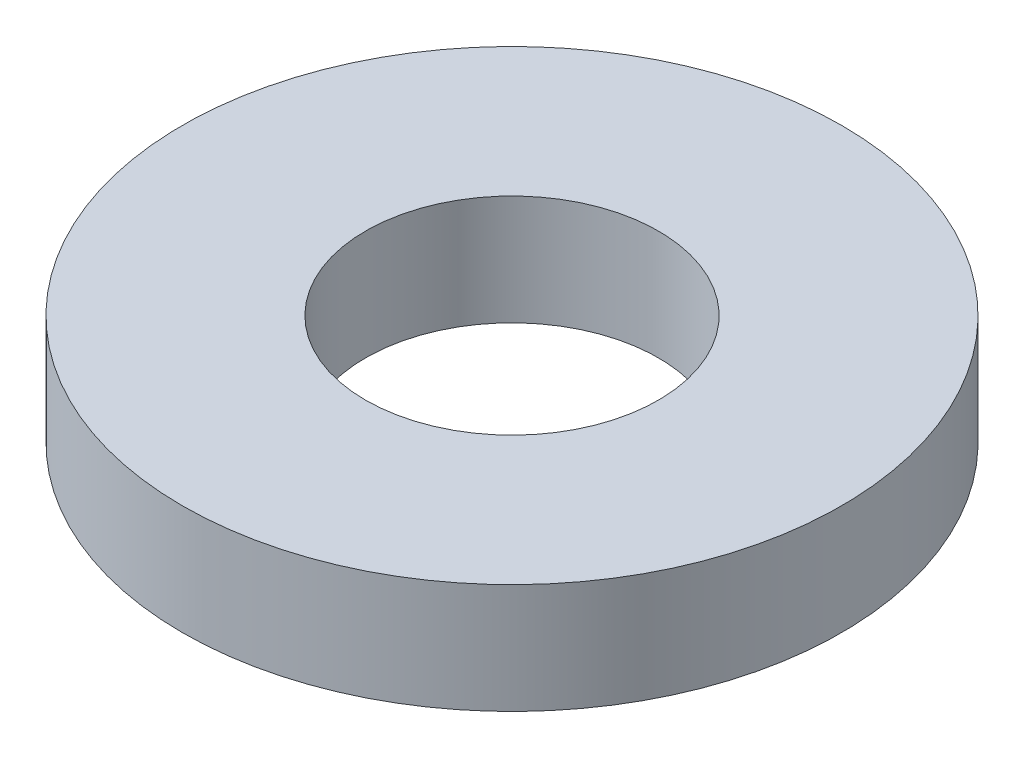
ISO-10303-21;
HEADER;
FILE_DESCRIPTION(('STEP AP214'),'2;1');
FILE_NAME('part.step','',(''),(''),'','','');
FILE_SCHEMA(('AUTOMOTIVE_DESIGN { 1 0 10303 214 1 1 1 1 }'));
ENDSEC;
DATA;
#1=APPLICATION_CONTEXT('core data for automotive mechanical design processes');
#2=APPLICATION_PROTOCOL_DEFINITION('international standard','automotive_design',2000,#1);
#3=PRODUCT_CONTEXT('',#1,'mechanical');
#4=PRODUCT('Part','Part','',(#3));
#5=PRODUCT_RELATED_PRODUCT_CATEGORY('part','',(#4));
#6=PRODUCT_DEFINITION_FORMATION('','',#4);
#7=PRODUCT_DEFINITION_CONTEXT('part definition',#1,'design');
#8=PRODUCT_DEFINITION('design','',#6,#7);
#9=PRODUCT_DEFINITION_SHAPE('','',#8);
#10=(LENGTH_UNIT() NAMED_UNIT(*) SI_UNIT(.MILLI.,.METRE.));
#11=(NAMED_UNIT(*) PLANE_ANGLE_UNIT() SI_UNIT($,.RADIAN.));
#12=(NAMED_UNIT(*) SI_UNIT($,.STERADIAN.) SOLID_ANGLE_UNIT());
#13=UNCERTAINTY_MEASURE_WITH_UNIT(LENGTH_MEASURE(1.E-05),#10,'distance_accuracy_value','');
#14=(GEOMETRIC_REPRESENTATION_CONTEXT(3) GLOBAL_UNCERTAINTY_ASSIGNED_CONTEXT((#13)) GLOBAL_UNIT_ASSIGNED_CONTEXT((#10,
#11,#12)) REPRESENTATION_CONTEXT('',''));
#15=CARTESIAN_POINT('',(0.,0.,0.));
#16=DIRECTION('',(0.,0.,1.));
#17=DIRECTION('',(1.,0.,0.));
#18=AXIS2_PLACEMENT_3D('',#15,#16,#17);
#19=CARTESIAN_POINT('',(0.,30.,0.));
#20=DIRECTION('',(0.,-1.,0.));
#21=DIRECTION('',(0.,0.,-1.));
#22=AXIS2_PLACEMENT_3D('',#19,#20,#21);
#23=CYLINDRICAL_SURFACE('',#22,90.);
#24=CARTESIAN_POINT('',(0.,30.,0.));
#25=DIRECTION('',(0.,1.,0.));
#26=DIRECTION('',(0.,0.,1.));
#27=AXIS2_PLACEMENT_3D('',#24,#25,#26);
#28=CIRCLE('',#27,90.);
#29=CARTESIAN_POINT('',(0.,30.,90.));
#30=VERTEX_POINT('',#29);
#31=EDGE_CURVE('E10',#30,#30,#28,.T.);
#32=ORIENTED_EDGE('',*,*,#31,.F.);
#33=EDGE_LOOP('',(#32));
#34=FACE_BOUND('',#33,.T.);
#35=CARTESIAN_POINT('',(0.,0.,0.));
#36=DIRECTION('',(0.,1.,0.));
#37=DIRECTION('',(0.,0.,1.));
#38=AXIS2_PLACEMENT_3D('',#35,#36,#37);
#39=CIRCLE('',#38,90.);
#40=CARTESIAN_POINT('',(0.,0.,90.));
#41=VERTEX_POINT('',#40);
#42=EDGE_CURVE('E37',#41,#41,#39,.T.);
#43=ORIENTED_EDGE('',*,*,#42,.T.);
#44=EDGE_LOOP('',(#43));
#45=FACE_BOUND('',#44,.T.);
#46=ADVANCED_FACE('F40',(#34,#45),#23,.T.);
#47=CARTESIAN_POINT('',(0.,30.,0.));
#48=DIRECTION('',(0.,1.,0.));
#49=DIRECTION('',(0.,0.,1.));
#50=AXIS2_PLACEMENT_3D('',#47,#48,#49);
#51=PLANE('',#50);
#52=CARTESIAN_POINT('',(0.,30.,0.));
#53=DIRECTION('',(0.,1.,0.));
#54=DIRECTION('',(0.,0.,1.));
#55=AXIS2_PLACEMENT_3D('',#52,#53,#54);
#56=CIRCLE('',#55,40.);
#57=CARTESIAN_POINT('',(0.,30.,40.));
#58=VERTEX_POINT('',#57);
#59=EDGE_CURVE('E50',#58,#58,#56,.T.);
#60=ORIENTED_EDGE('',*,*,#59,.F.);
#61=EDGE_LOOP('',(#60));
#62=FACE_BOUND('',#61,.T.);
#63=ORIENTED_EDGE('',*,*,#31,.T.);
#64=EDGE_LOOP('',(#63));
#65=FACE_BOUND('',#64,.T.);
#66=ADVANCED_FACE('F59',(#62,#65),#51,.T.);
#67=CARTESIAN_POINT('',(0.,0.,0.));
#68=DIRECTION('',(0.,1.,0.));
#69=DIRECTION('',(0.,0.,1.));
#70=AXIS2_PLACEMENT_3D('',#67,#68,#69);
#71=PLANE('',#70);
#72=CARTESIAN_POINT('',(0.,0.,0.));
#73=DIRECTION('',(0.,1.,0.));
#74=DIRECTION('',(0.,0.,1.));
#75=AXIS2_PLACEMENT_3D('',#72,#73,#74);
#76=CIRCLE('',#75,40.);
#77=CARTESIAN_POINT('',(0.,0.,40.));
#78=VERTEX_POINT('',#77);
#79=EDGE_CURVE('E47',#78,#78,#76,.T.);
#80=ORIENTED_EDGE('',*,*,#79,.T.);
#81=EDGE_LOOP('',(#80));
#82=FACE_BOUND('',#81,.T.);
#83=ORIENTED_EDGE('',*,*,#42,.F.);
#84=EDGE_LOOP('',(#83));
#85=FACE_BOUND('',#84,.T.);
#86=ADVANCED_FACE('F58',(#82,#85),#71,.F.);
#87=CARTESIAN_POINT('',(0.,30.,0.));
#88=DIRECTION('',(0.,-1.,0.));
#89=DIRECTION('',(0.,0.,-1.));
#90=AXIS2_PLACEMENT_3D('',#87,#88,#89);
#91=CYLINDRICAL_SURFACE('',#90,40.);
#92=ORIENTED_EDGE('',*,*,#59,.T.);
#93=EDGE_LOOP('',(#92));
#94=FACE_BOUND('',#93,.T.);
#95=ORIENTED_EDGE('',*,*,#79,.F.);
#96=EDGE_LOOP('',(#95));
#97=FACE_BOUND('',#96,.T.);
#98=ADVANCED_FACE('F54',(#94,#97),#91,.F.);
#99=CLOSED_SHELL('',(#46,#66,#86,#98));
#100=MANIFOLD_SOLID_BREP('B2',#99);
#101=ADVANCED_BREP_SHAPE_REPRESENTATION('',(#18,#100),#14);
#102=SHAPE_DEFINITION_REPRESENTATION(#9,#101);
ENDSEC;
END-ISO-10303-21;
